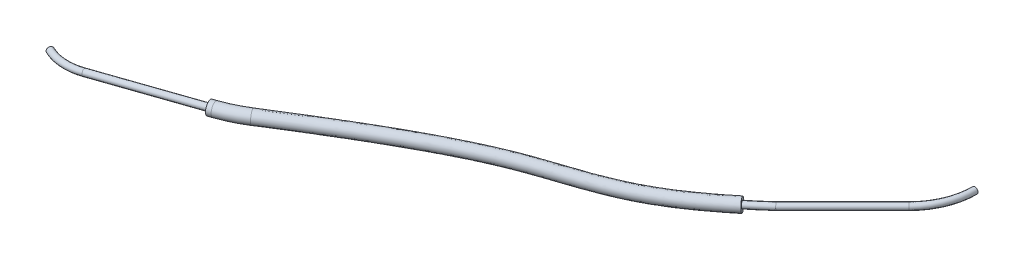
ISO-10303-21;
HEADER;
FILE_DESCRIPTION(('STEP AP214'),'2;1');
FILE_NAME('part.step','',(''),(''),'','','');
FILE_SCHEMA(('AUTOMOTIVE_DESIGN { 1 0 10303 214 1 1 1 1 }'));
ENDSEC;
DATA;
#1=APPLICATION_CONTEXT('core data for automotive mechanical design processes');
#2=APPLICATION_PROTOCOL_DEFINITION('international standard','automotive_design',2000,#1);
#3=PRODUCT_CONTEXT('',#1,'mechanical');
#4=PRODUCT('Part','Part','',(#3));
#5=PRODUCT_RELATED_PRODUCT_CATEGORY('part','',(#4));
#6=PRODUCT_DEFINITION_FORMATION('','',#4);
#7=PRODUCT_DEFINITION_CONTEXT('part definition',#1,'design');
#8=PRODUCT_DEFINITION('design','',#6,#7);
#9=PRODUCT_DEFINITION_SHAPE('','',#8);
#10=(LENGTH_UNIT() NAMED_UNIT(*) SI_UNIT(.MILLI.,.METRE.));
#11=(NAMED_UNIT(*) PLANE_ANGLE_UNIT() SI_UNIT($,.RADIAN.));
#12=(NAMED_UNIT(*) SI_UNIT($,.STERADIAN.) SOLID_ANGLE_UNIT());
#13=UNCERTAINTY_MEASURE_WITH_UNIT(LENGTH_MEASURE(1.E-05),#10,'distance_accuracy_value','');
#14=(GEOMETRIC_REPRESENTATION_CONTEXT(3) GLOBAL_UNCERTAINTY_ASSIGNED_CONTEXT((#13)) GLOBAL_UNIT_ASSIGNED_CONTEXT((#10,
#11,#12)) REPRESENTATION_CONTEXT('',''));
#15=CARTESIAN_POINT('',(0.,0.,0.));
#16=DIRECTION('',(0.,0.,1.));
#17=DIRECTION('',(1.,0.,0.));
#18=AXIS2_PLACEMENT_3D('',#15,#16,#17);
#19=CARTESIAN_POINT('',(-65.4426826596418,2.06849233706446,49.9182708471425));
#20=CARTESIAN_POINT('',(-64.6102753777619,2.06849233706446,49.391673894219));
#21=CARTESIAN_POINT('',(-63.7929251499852,2.06700167169548,48.8755477676007));
#22=CARTESIAN_POINT('',(-62.1339599421459,2.06054145969654,47.8301746670578));
#23=CARTESIAN_POINT('',(-61.3030964183681,2.05557102387871,47.3077297979915));
#24=CARTESIAN_POINT('',(-58.8215813451933,2.0347770937374,45.7512162617422));
#25=CARTESIAN_POINT('',(-57.1819886843264,2.01300027820405,44.7279976841103));
#26=CARTESIAN_POINT('',(-52.4296548507018,1.92047417208794,41.7817859247177));
#27=CARTESIAN_POINT('',(-49.5025366881248,1.82191582611916,39.9946527482901));
#28=CARTESIAN_POINT('',(-44.4018571153965,1.55219085838636,36.9506652043236));
#29=CARTESIAN_POINT('',(-42.2558866226073,1.38262635289105,35.71018113905));
#30=CARTESIAN_POINT('',(-38.6042879357305,1.00423719023995,33.6747761150723));
#31=CARTESIAN_POINT('',(-37.1058669510985,0.796083958782148,32.8841045188624));
#32=CARTESIAN_POINT('',(-32.3335035915576,0.137244470140917,30.4101112448493));
#33=CARTESIAN_POINT('',(-29.3738064994366,-0.250248504691796,28.9507030985919));
#34=CARTESIAN_POINT('',(-22.4585702623827,-0.520796958339956,24.8597915613958));
#35=CARTESIAN_POINT('',(-18.423417511007,-0.394775833983985,22.1557666566223));
#36=CARTESIAN_POINT('',(-13.3244043673123,0.00183984264517314,18.3869241579518));
#37=CARTESIAN_POINT('',(-13.270944706091,0.00599818721492958,18.3474102776392));
#38=CARTESIAN_POINT('',(-13.2174376093601,0.0101601710598621,18.3078614099652));
#39=CARTESIAN_POINT('',(-65.4381107979406,3.06845577156662,49.9254977233154));
#40=CARTESIAN_POINT('',(-64.6050922343713,3.06845577156662,49.3985140617673));
#41=CARTESIAN_POINT('',(-63.7865733867491,3.06696357092638,48.8816496181198));
#42=CARTESIAN_POINT('',(-62.1256223264723,3.06049562576873,47.835025162853));
#43=CARTESIAN_POINT('',(-61.2936940508778,3.05551899800707,47.3119106662541));
#44=CARTESIAN_POINT('',(-58.8087362582996,3.03469621948344,45.7532377116805));
#45=CARTESIAN_POINT('',(-57.1665174055428,3.01288698679012,44.7283785866687));
#46=CARTESIAN_POINT('',(-52.4050143259691,2.92018235903236,41.7764823657161));
#47=CARTESIAN_POINT('',(-49.47006761625,2.8214130863456,39.9845327487139));
#48=CARTESIAN_POINT('',(-44.3482758505009,2.55057170291108,36.9279459271482));
#49=CARTESIAN_POINT('',(-42.1885467724541,2.38001772986634,35.67943423222));
#50=CARTESIAN_POINT('',(-38.5083815746263,1.99866842814678,33.6281063224491));
#51=CARTESIAN_POINT('',(-36.9954275717413,1.78848513561747,32.8298370713756));
#52=CARTESIAN_POINT('',(-32.2271851522407,1.1302145560084,30.3579801029781));
#53=CARTESIAN_POINT('',(-29.3035152692518,0.747674788959855,28.9165195231707));
#54=CARTESIAN_POINT('',(-22.4644474862148,0.480106329948712,24.8706699632628));
#55=CARTESIAN_POINT('',(-18.4637070528184,0.603818369143604,22.1913415799205));
#56=CARTESIAN_POINT('',(-13.3719138530857,0.999872464873213,18.4278355613067));
#57=CARTESIAN_POINT('',(-13.3183783613633,1.00403670768279,18.3882656323656));
#58=CARTESIAN_POINT('',(-13.2648712646325,1.00819869152773,18.3487167646916));
#59=CARTESIAN_POINT('',(-65.9727126154962,3.07700735964332,49.080436916623));
#60=CARTESIAN_POINT('',(-65.1607274190772,3.07700735964333,48.5667593701128));
#61=CARTESIAN_POINT('',(-64.3201988744975,3.07551432129176,48.0359716980104));
#62=CARTESIAN_POINT('',(-62.6581498300179,3.06904210186145,46.9886553637765));
#63=CARTESIAN_POINT('',(-61.8256299161155,3.06406204155318,46.4651687778065));
#64=CARTESIAN_POINT('',(-59.3387467631631,3.04322313290593,44.9052881540032));
#65=CARTESIAN_POINT('',(-57.6950445453075,3.02139571237269,43.8795023095906));
#66=CARTESIAN_POINT('',(-52.9282735509548,2.92858853487628,40.9243402423145));
#67=CARTESIAN_POINT('',(-49.9887559087386,2.82970040734503,39.1295753690479));
#68=CARTESIAN_POINT('',(-44.8538592637965,2.5581660984793,36.0651678080226));
#69=CARTESIAN_POINT('',(-42.6853370021809,2.38699985190207,34.8115094615921));
#70=CARTESIAN_POINT('',(-38.9843890052978,2.00349708059357,32.7485971980384));
#71=CARTESIAN_POINT('',(-37.4592056149536,1.79164389560076,31.9438806081163));
#72=CARTESIAN_POINT('',(-32.6779917115173,1.13158257175767,29.4652992221522));
#73=CARTESIAN_POINT('',(-29.7769317773052,0.752648875727635,28.0347260838656));
#74=CARTESIAN_POINT('',(-23.0089551075967,0.487863711207262,24.0309325790171));
#75=CARTESIAN_POINT('',(-19.0493347837529,0.609169364875249,21.3807017012264));
#76=CARTESIAN_POINT('',(-13.9666292911484,1.004516601715,17.6239126829848));
#77=CARTESIAN_POINT('',(-13.912998351956,1.00868826860766,17.5842722059195));
#78=CARTESIAN_POINT('',(-13.8594912552251,1.01285025245259,17.5447233382454));
#79=CARTESIAN_POINT('',(-65.9772844771974,2.07704392514116,49.07321004045));
#80=CARTESIAN_POINT('',(-65.1659105624679,2.07704392514116,48.5599192025645));
#81=CARTESIAN_POINT('',(-64.3265506377336,2.07555242206096,48.0298698474913));
#82=CARTESIAN_POINT('',(-62.6664874456915,2.06908793578915,46.9838048679813));
#83=CARTESIAN_POINT('',(-61.8350322836058,2.06411406742471,46.4609879095439));
#84=CARTESIAN_POINT('',(-59.3515918500569,2.0433040071601,44.9032667040649));
#85=CARTESIAN_POINT('',(-57.7105158240911,2.02150900378682,43.879121407029));
#86=CARTESIAN_POINT('',(-52.9529140756875,1.92888034793146,40.9296438013226));
#87=CARTESIAN_POINT('',(-50.0212249806134,1.83020314711826,39.1396953686241));
#88=CARTESIAN_POINT('',(-44.9074405286921,1.5597852539549,36.087887085198));
#89=CARTESIAN_POINT('',(-42.7526768523342,1.38960847492678,34.842256368422));
#90=CARTESIAN_POINT('',(-39.080295366402,1.00906584268674,32.7952669906617));
#91=CARTESIAN_POINT('',(-37.5696449943108,0.799242718765438,31.9981480556017));
#92=CARTESIAN_POINT('',(-32.7843101508342,0.138612485890187,29.5174303640267));
#93=CARTESIAN_POINT('',(-29.8472230074899,-0.245274417924015,28.0689096592868));
#94=CARTESIAN_POINT('',(-23.0030778837645,-0.513039577081406,24.0200541771501));
#95=CARTESIAN_POINT('',(-19.0090452419415,-0.389424838252339,21.3451267779283));
#96=CARTESIAN_POINT('',(-13.919119805375,0.00648397948695943,17.58300127963));
#97=CARTESIAN_POINT('',(-13.8655646966836,0.0106497481397963,17.5434168511931));
#98=CARTESIAN_POINT('',(-13.8120575999528,0.0148117319847287,17.5038679835191));
#99=CARTESIAN_POINT('',(-65.9818563388986,1.07708049063899,49.0659831642771));
#100=CARTESIAN_POINT('',(-65.1710937058585,1.077080490639,48.5530790350161));
#101=CARTESIAN_POINT('',(-64.3329024009697,1.07559052283016,48.0237679969721));
#102=CARTESIAN_POINT('',(-62.6748250613651,1.06913376971684,46.9789543721861));
#103=CARTESIAN_POINT('',(-61.844434651096,1.06416609329625,46.4568070412814));
#104=CARTESIAN_POINT('',(-59.3644369369507,1.04338488141427,44.9012452541266));
#105=CARTESIAN_POINT('',(-57.7259871028747,1.02162229520095,43.8787405044673));
#106=CARTESIAN_POINT('',(-52.9775546004201,0.929172160986636,40.9349473603306));
#107=CARTESIAN_POINT('',(-50.0536940524883,0.830705886891494,39.1498153682004));
#108=CARTESIAN_POINT('',(-44.9610217935878,0.561404409430505,36.1106063623733));
#109=CARTESIAN_POINT('',(-42.8200167024874,0.392217097951485,34.8730032752519));
#110=CARTESIAN_POINT('',(-39.1762017275061,0.0146346047799046,32.8419367832849));
#111=CARTESIAN_POINT('',(-37.6800843736681,-0.193158458069882,32.0524155030871));
#112=CARTESIAN_POINT('',(-32.8906285901511,-0.854357599977295,29.5695615059013));
#113=CARTESIAN_POINT('',(-29.9175142376746,-1.24319771157567,28.103093234708));
#114=CARTESIAN_POINT('',(-22.9972006599323,-1.51394286537007,24.0091757752831));
#115=CARTESIAN_POINT('',(-18.9687557001301,-1.38801904137993,21.3095518546301));
#116=CARTESIAN_POINT('',(-13.8716103196015,-0.99154864274108,17.5420898762751));
#117=CARTESIAN_POINT('',(-13.8181310414113,-0.987388772328068,17.5025614964667));
#118=CARTESIAN_POINT('',(-13.7646239446804,-0.983226788483136,17.4630126287927));
#119=CARTESIAN_POINT('',(-65.447254521343,1.06852890256229,49.9110439709695));
#120=CARTESIAN_POINT('',(-64.6154585211526,1.06852890256229,49.3848337266706));
#121=CARTESIAN_POINT('',(-63.7992769132212,1.06703977246457,48.8694459170815));
#122=CARTESIAN_POINT('',(-62.1422975578195,1.06058729362434,47.8253241712626));
#123=CARTESIAN_POINT('',(-61.3124987858583,1.05562304975035,47.3035489297289));
#124=CARTESIAN_POINT('',(-58.8344264320871,1.03485796799136,45.7491948118039));
#125=CARTESIAN_POINT('',(-57.19745996311,1.01311356961798,44.7276167815518));
#126=CARTESIAN_POINT('',(-52.4542953754344,0.920765985143523,41.7870894837192));
#127=CARTESIAN_POINT('',(-49.5350057599997,0.822418565892712,40.0047727478663));
#128=CARTESIAN_POINT('',(-44.4554383802922,0.553810013861637,36.9733844814989));
#129=CARTESIAN_POINT('',(-42.3232264727606,0.385234975915752,35.7409280458799));
#130=CARTESIAN_POINT('',(-38.7001942968346,0.00980595233311817,33.7214459076956));
#131=CARTESIAN_POINT('',(-37.2163063304558,-0.196317218053172,32.9383719663492));
#132=CARTESIAN_POINT('',(-32.4398220308745,-0.855725615726565,30.4622423867205));
#133=CARTESIAN_POINT('',(-29.4440977296213,-1.24817179834345,28.9848866740131));
#134=CARTESIAN_POINT('',(-22.4526930385505,-1.52170024662862,24.8489131595288));
#135=CARTESIAN_POINT('',(-18.3831279691956,-1.39337003711157,22.1201917333241));
#136=CARTESIAN_POINT('',(-13.2768948815388,-0.996192779582866,18.3460127545969));
#137=CARTESIAN_POINT('',(-13.2235110508186,-0.992040333252935,18.3065549229128));
#138=CARTESIAN_POINT('',(-13.1700039540878,-0.987878349408002,18.2670060552388));
#139=CARTESIAN_POINT('',(-65.4426826596418,2.06849233706446,49.9182708471425));
#140=CARTESIAN_POINT('',(-64.6102753777619,2.06849233706446,49.391673894219));
#141=CARTESIAN_POINT('',(-63.7929251499852,2.06700167169548,48.8755477676007));
#142=CARTESIAN_POINT('',(-62.1339599421459,2.06054145969654,47.8301746670578));
#143=CARTESIAN_POINT('',(-61.3030964183681,2.05557102387871,47.3077297979915));
#144=CARTESIAN_POINT('',(-58.8215813451933,2.0347770937374,45.7512162617422));
#145=CARTESIAN_POINT('',(-57.1819886843264,2.01300027820405,44.7279976841103));
#146=CARTESIAN_POINT('',(-52.4296548507018,1.92047417208794,41.7817859247177));
#147=CARTESIAN_POINT('',(-49.5025366881248,1.82191582611916,39.9946527482901));
#148=CARTESIAN_POINT('',(-44.4018571153965,1.55219085838636,36.9506652043236));
#149=CARTESIAN_POINT('',(-42.2558866226073,1.38262635289105,35.71018113905));
#150=CARTESIAN_POINT('',(-38.6042879357305,1.00423719023995,33.6747761150723));
#151=CARTESIAN_POINT('',(-37.1058669510985,0.796083958782148,32.8841045188624));
#152=CARTESIAN_POINT('',(-32.3335035915576,0.137244470140917,30.4101112448493));
#153=CARTESIAN_POINT('',(-29.3738064994366,-0.250248504691796,28.9507030985919));
#154=CARTESIAN_POINT('',(-22.4585702623827,-0.520796958339956,24.8597915613958));
#155=CARTESIAN_POINT('',(-18.423417511007,-0.394775833983985,22.1557666566223));
#156=CARTESIAN_POINT('',(-13.3244043673123,0.00183984264517314,18.3869241579518));
#157=CARTESIAN_POINT('',(-13.270944706091,0.00599818721492958,18.3474102776392));
#158=CARTESIAN_POINT('',(-13.2174376093601,0.0101601710598621,18.3078614099652));
#159=(BOUNDED_SURFACE() B_SPLINE_SURFACE(3,3,((#19,#20,#21,#22,#23,#24,#25,#26,#27,#28,#29,#30,
#31,#32,#33,#34,#35,#36,#37,#38),(#39,#40,#41,#42,#43,#44,#45,#46,#47,#48,#49,#50,#51,#52,#53,
#54,#55,#56,#57,#58),(#59,#60,#61,#62,#63,#64,#65,#66,#67,#68,#69,#70,#71,#72,#73,#74,#75,#76,
#77,#78),(#79,#80,#81,#82,#83,#84,#85,#86,#87,#88,#89,#90,#91,#92,#93,#94,#95,#96,#97,#98),(#99,
#100,#101,#102,#103,#104,#105,#106,#107,#108,#109,#110,#111,#112,#113,#114,#115,#116,#117,#118),
(#119,#120,#121,#122,#123,#124,#125,#126,#127,#128,#129,#130,#131,#132,#133,#134,#135,#136,#137,
#138),(#139,#140,#141,#142,#143,#144,#145,#146,#147,#148,#149,#150,#151,#152,#153,#154,#155,
#156,#157,#158)),.UNSPECIFIED.,.T.,.F.,.F.) B_SPLINE_SURFACE_WITH_KNOTS((4,3,4),(4,2,2,2,2,2,2,
2,2,4),(0.,0.5,1.),(0.305472754896942,0.325269174044409,0.345065593191876,0.38465843148681,
0.463844108076677,0.543029784666545,0.622215461256412,0.811107730628206,1.,1.00200497871636),
.UNSPECIFIED.) GEOMETRIC_REPRESENTATION_ITEM() RATIONAL_B_SPLINE_SURFACE(((1.,1.,1.,1.,1.,1.,1.,
1.,1.,1.,1.,1.,1.,1.,1.,1.,1.,1.,1.,1.),(0.333333333333333,0.333333333333333,0.333333333333333,
0.333333333333333,0.333333333333333,0.333333333333333,0.333333333333333,0.333333333333333,
0.333333333333333,0.333333333333333,0.333333333333333,0.333333333333333,0.333333333333333,
0.333333333333333,0.333333333333333,0.333333333333333,0.333333333333333,0.333333333333333,
0.333333333333333,0.333333333333333),(0.333333333333333,0.333333333333333,0.333333333333333,
0.333333333333333,0.333333333333333,0.333333333333333,0.333333333333333,0.333333333333333,
0.333333333333333,0.333333333333333,0.333333333333333,0.333333333333333,0.333333333333333,
0.333333333333333,0.333333333333333,0.333333333333333,0.333333333333333,0.333333333333333,
0.333333333333333,0.333333333333333),(1.,1.,1.,1.,1.,1.,1.,1.,1.,1.,1.,1.,1.,1.,1.,1.,1.,1.,1.,
1.),(0.333333333333333,0.333333333333333,0.333333333333333,0.333333333333333,0.333333333333333,
0.333333333333333,0.333333333333333,0.333333333333333,0.333333333333333,0.333333333333333,
0.333333333333333,0.333333333333333,0.333333333333333,0.333333333333333,0.333333333333333,
0.333333333333333,0.333333333333333,0.333333333333333,0.333333333333333,0.333333333333333),
(0.333333333333333,0.333333333333333,0.333333333333333,0.333333333333333,0.333333333333333,
0.333333333333333,0.333333333333333,0.333333333333333,0.333333333333333,0.333333333333333,
0.333333333333333,0.333333333333333,0.333333333333333,0.333333333333333,0.333333333333333,
0.333333333333333,0.333333333333333,0.333333333333333,0.333333333333333,0.333333333333333),(1.,
1.,1.,1.,1.,1.,1.,1.,1.,1.,1.,1.,1.,1.,1.,1.,1.,1.,1.,1.))) REPRESENTATION_ITEM('') SURFACE());
#160=CARTESIAN_POINT('',(-13.5378979215375,-0.460715130419295,18.161882273065));
#161=CARTESIAN_POINT('',(-13.5356865562389,-0.459269794244226,18.1645190911536));
#162=CARTESIAN_POINT('',(-13.5334861260916,-0.457785587784182,18.167145079573));
#163=CARTESIAN_POINT('',(-13.5147623508182,-0.444761439303766,18.1895089468534));
#164=CARTESIAN_POINT('',(-13.4988857468484,-0.431070062646096,18.2085992418412));
#165=CARTESIAN_POINT('',(-13.4689286861008,-0.399694021228154,18.2448861923355));
#166=CARTESIAN_POINT('',(-13.4548529472416,-0.381999190505139,18.2620778583269));
#167=CARTESIAN_POINT('',(-13.4289455499903,-0.343149602673817,18.2940218901515));
#168=CARTESIAN_POINT('',(-13.4171111157445,-0.321999186615379,18.3087772703792));
#169=CARTESIAN_POINT('',(-13.3960082903749,-0.276821295379049,18.3354469439945));
#170=CARTESIAN_POINT('',(-13.3867400843688,-0.252793612825486,18.3473610324139));
#171=CARTESIAN_POINT('',(-13.3710511189185,-0.202584500542406,18.3679866834344));
#172=CARTESIAN_POINT('',(-13.3646257108553,-0.176406670542718,18.3767034703273));
#173=CARTESIAN_POINT('',(-13.354788090261,-0.122603880122333,18.3907081569449));
#174=CARTESIAN_POINT('',(-13.3513761893007,-0.0949787703780195,18.3959957021004));
#175=CARTESIAN_POINT('',(-13.3476762103342,-0.03918035333438,18.402970307561));
#176=CARTESIAN_POINT('',(-13.3473762536086,-0.011009542164359,18.4046710393928));
#177=CARTESIAN_POINT('',(-13.3498835127891,0.0452162878670125,18.4044594711936));
#178=CARTESIAN_POINT('',(-13.3526946684538,0.0732711146472754,18.4025425878237));
#179=CARTESIAN_POINT('',(-13.3613376194082,0.128329015074114,18.3951513195469));
#180=CARTESIAN_POINT('',(-13.3671589082242,0.155335397962775,18.3896892916867));
#181=CARTESIAN_POINT('',(-13.3816514764019,0.207629895870593,18.3753738606882));
#182=CARTESIAN_POINT('',(-13.3903227344975,0.232918023709458,18.3665204828555));
#183=CARTESIAN_POINT('',(-13.4102613421827,0.281040770027418,18.3456818329595));
#184=CARTESIAN_POINT('',(-13.4215269851704,0.303876986972607,18.3336986190292));
#185=CARTESIAN_POINT('',(-13.4463198669805,0.346441229793133,18.3069572194803));
#186=CARTESIAN_POINT('',(-13.4598442162993,0.366173165048698,18.2922025763092));
#187=CARTESIAN_POINT('',(-13.4888013861653,0.4020366978953,18.2603046726395));
#188=CARTESIAN_POINT('',(-13.5042370237043,0.41816288052627,18.2431578815968));
#189=CARTESIAN_POINT('',(-13.5365601644972,0.44632558706743,18.2069823151779));
#190=CARTESIAN_POINT('',(-13.5534475464364,0.458362452285035,18.187953697036));
#191=CARTESIAN_POINT('',(-13.5883004702156,0.478074706897065,18.1484353041196));
#192=CARTESIAN_POINT('',(-13.6062718057364,0.485723840060997,18.127937542219));
#193=CARTESIAN_POINT('',(-13.6426886739558,0.496338543886833,18.0861666080557));
#194=CARTESIAN_POINT('',(-13.661134180966,0.499304367725437,18.0648934777725));
#195=CARTESIAN_POINT('',(-13.6979940146055,0.500478997663377,18.0221550312929));
#196=CARTESIAN_POINT('',(-13.7164082846383,0.498682568844151,18.000689529475));
#197=CARTESIAN_POINT('',(-13.7526357057766,0.490378169591167,17.9582302310792));
#198=CARTESIAN_POINT('',(-13.7704501543346,0.48388115763061,17.9372354542602));
#199=CARTESIAN_POINT('',(-13.7938785162996,0.472020812360587,17.9094653404048));
#200=CARTESIAN_POINT('',(-13.799976713768,0.468611532299088,17.9022215570365));
#201=CARTESIAN_POINT('',(-13.8082215848415,0.463557936257391,17.8924065080213));
#202=CARTESIAN_POINT('',(-13.8104363186998,0.462155531277695,17.889767837481));
#203=CARTESIAN_POINT('',(-13.8126398764997,0.460715125416697,17.8871403181087));
#204=B_SPLINE_CURVE_WITH_KNOTS('',3,(#160,#161,#162,#163,#164,#165,#166,#167,#168,#169,#170,
#171,#172,#173,#174,#175,#176,#177,#178,#179,#180,#181,#182,#183,#184,#185,#186,#187,#188,#189,
#190,#191,#192,#193,#194,#195,#196,#197,#198,#199,#200,#201,#202,#203),.UNSPECIFIED.,.F.,.F.,(4,
2,2,2,2,2,2,2,2,2,2,2,2,2,2,2,2,2,2,2,2,4),(0.,0.0112000663848856,0.0958052396493848,
0.180627711098075,0.265344432985468,0.350067264412228,0.434651038083643,0.519243555969623,
0.603513053224276,0.687889387428363,0.771973185388852,0.856056355940638,0.940084373270497,
1.0240057077981,1.10805223763035,1.19209175094806,1.27662904770678,1.36116177427694,
1.44578746218685,1.53021649527374,1.56039478878953,1.57155247138295),.UNSPECIFIED.);
#205=CARTESIAN_POINT('',(-13.5378979215375,-0.460715130419295,18.161882273065));
#206=VERTEX_POINT('',#205);
#207=CARTESIAN_POINT('',(-13.8126398764997,0.460715125416697,17.8871403181087));
#208=VERTEX_POINT('',#207);
#209=EDGE_CURVE('E45',#206,#208,#204,.T.);
#210=CARTESIAN_POINT('',(-13.5378979215375,-0.460715130419295,18.161882273065));
#211=CARTESIAN_POINT('',(-13.5401092840379,-0.462160882237253,18.1592456805021));
#212=CARTESIAN_POINT('',(-13.5423326762077,-0.463568479870211,18.1565969500472));
#213=CARTESIAN_POINT('',(-13.561448846803,-0.475279895617532,18.133842548911));
#214=CARTESIAN_POINT('',(-13.5789794919363,-0.483426524539769,18.1130996889565));
#215=CARTESIAN_POINT('',(-13.614823236526,-0.49506400228763,18.0709284942048));
#216=CARTESIAN_POINT('',(-13.6331382299992,-0.498542839431998,18.0494985356638));
#217=CARTESIAN_POINT('',(-13.6699826224744,-0.50071400508809,18.006618808449));
#218=CARTESIAN_POINT('',(-13.6885117256247,-0.499412297110749,17.9851690978045));
#219=CARTESIAN_POINT('',(-13.7252765162659,-0.492062832103886,17.9428374716927));
#220=CARTESIAN_POINT('',(-13.7435121824848,-0.486014732566532,17.9219555973139));
#221=CARTESIAN_POINT('',(-13.7791396483347,-0.469351892507442,17.881390152715));
#222=CARTESIAN_POINT('',(-13.7965327796937,-0.458744639022881,17.8617046780027));
#223=CARTESIAN_POINT('',(-13.8300108112177,-0.433258227775062,17.8240571341033));
#224=CARTESIAN_POINT('',(-13.846095575916,-0.418378628378532,17.8060952433397));
#225=CARTESIAN_POINT('',(-13.8764338665733,-0.384832076795157,17.7724790116121));
#226=CARTESIAN_POINT('',(-13.890694143873,-0.36617978824448,17.7568161296995));
#227=CARTESIAN_POINT('',(-13.9170633264874,-0.325553481101683,17.7281474566164));
#228=CARTESIAN_POINT('',(-13.9291694813903,-0.30357528122789,17.7151450592582));
#229=CARTESIAN_POINT('',(-13.9508216913128,-0.257022521653243,17.6922373208746));
#230=CARTESIAN_POINT('',(-13.9603764845967,-0.232457236498461,17.6823213890335));
#231=CARTESIAN_POINT('',(-13.9767084592294,-0.181366041911645,17.6658088170999));
#232=CARTESIAN_POINT('',(-13.9834856614682,-0.154840147226906,17.6592121520435));
#233=CARTESIAN_POINT('',(-13.9940666339223,-0.100601126885592,17.6495285289695));
#234=CARTESIAN_POINT('',(-13.9978723732716,-0.0728888003231526,17.6464392460566));
#235=CARTESIAN_POINT('',(-14.0024092071459,-0.0170838262586906,17.6438492936803));
#236=CARTESIAN_POINT('',(-14.0031441992031,0.0110082937044616,17.6443440729789));
#237=CARTESIAN_POINT('',(-14.0015318835133,0.0668547611503039,17.6488967179982));
#238=CARTESIAN_POINT('',(-13.9991799900579,0.0946085441528046,17.6529598817467));
#239=CARTESIAN_POINT('',(-13.9914573697355,0.148949203133318,17.6645357908128));
#240=CARTESIAN_POINT('',(-13.986086894811,0.175536176298153,17.6720482482295));
#241=CARTESIAN_POINT('',(-13.9724431448333,0.226951458678321,17.6903595321044));
#242=CARTESIAN_POINT('',(-13.9641528363509,0.251768397749509,17.7011775923276));
#243=CARTESIAN_POINT('',(-13.9449155472735,0.298765500325206,17.7257720037564));
#244=CARTESIAN_POINT('',(-13.9339687101659,0.3209458061461,17.7395481951796));
#245=CARTESIAN_POINT('',(-13.909722116234,0.362067204812042,17.7696770753309));
#246=CARTESIAN_POINT('',(-13.8964197856481,0.38100470938512,17.7860325802199));
#247=CARTESIAN_POINT('',(-13.8678687816414,0.415047572403232,17.8208193347297));
#248=CARTESIAN_POINT('',(-13.8526247029845,0.430161733761824,17.8392456723938));
#249=CARTESIAN_POINT('',(-13.8309218109392,0.447804762251086,17.8652927886424));
#250=CARTESIAN_POINT('',(-13.8251119521665,0.452180057786229,17.872248873063));
#251=CARTESIAN_POINT('',(-13.8170352451886,0.457796248562836,17.881896605423));
#252=CARTESIAN_POINT('',(-13.8148432790117,0.459274602680102,17.8845127325923));
#253=CARTESIAN_POINT('',(-13.8126398764997,0.460715125416697,17.8871403181087));
#254=B_SPLINE_CURVE_WITH_KNOTS('',3,(#210,#211,#212,#213,#214,#215,#216,#217,#218,#219,#220,
#221,#222,#223,#224,#225,#226,#227,#228,#229,#230,#231,#232,#233,#234,#235,#236,#237,#238,#239,
#240,#241,#242,#243,#244,#245,#246,#247,#248,#249,#250,#251,#252,#253),.UNSPECIFIED.,.F.,.F.,(4,
2,2,2,2,2,2,2,2,2,2,2,2,2,2,2,2,2,2,2,2,4),(0.,0.0112000663874568,0.0958051101549704,
0.180627454146606,0.26534402211359,0.350066703936942,0.434650782689015,0.519243608064364,
0.603513748150849,0.687890725212272,0.771974897582945,0.856058437554404,0.940086209500611,
1.024007297113,1.10805319452147,1.19209207817645,1.27662956924746,1.3611624952018,
1.44578836365626,1.53021757770864,1.56039604702367,1.57155372961462),.UNSPECIFIED.);
#255=EDGE_CURVE('E88',#206,#208,#254,.T.);
#256=CARTESIAN_POINT('',(-16.5050018744213,-0.219071813146706,20.6994341208813));
#257=CARTESIAN_POINT('',(-16.5060329780596,-0.191001092454372,20.70036871886));
#258=CARTESIAN_POINT('',(-16.508446831216,-0.162935365825468,20.6993677582702));
#259=CARTESIAN_POINT('',(-16.5159704711166,-0.107529866635176,20.6935314456114));
#260=CARTESIAN_POINT('',(-16.5210834966095,-0.0801910077285436,20.6886914835944));
#261=CARTESIAN_POINT('',(-16.5338599799979,-0.0270803038708845,20.6753095490744));
#262=CARTESIAN_POINT('',(-16.5415218819515,-0.00130751424848186,20.6667698340981));
#263=CARTESIAN_POINT('',(-16.5591793921245,0.0479614462917393,20.6462315956375));
#264=CARTESIAN_POINT('',(-16.5691750665521,0.0714575525942129,20.6342329740232));
#265=CARTESIAN_POINT('',(-16.5912148648392,0.115500987542944,20.6071192010348));
#266=CARTESIAN_POINT('',(-16.6032587059818,0.13604872244443,20.5920044797279));
#267=CARTESIAN_POINT('',(-16.6290544311729,0.173616786661499,20.5590858898165));
#268=CARTESIAN_POINT('',(-16.6428063811589,0.190636979737117,20.541281917394));
#269=CARTESIAN_POINT('',(-16.6716161646539,0.220653799228828,20.5035056144992));
#270=CARTESIAN_POINT('',(-16.6866729714193,0.233653553032602,20.4835349858268));
#271=CARTESIAN_POINT('',(-16.7176956324772,0.255293531900468,20.4419522787048));
#272=CARTESIAN_POINT('',(-16.7336626725632,0.263927918631737,20.4203380462491));
#273=CARTESIAN_POINT('',(-16.7660222519681,0.276561300214824,20.3761214824634));
#274=CARTESIAN_POINT('',(-16.78241448946,0.280563495891872,20.3535198446467));
#275=CARTESIAN_POINT('',(-16.8151706317794,0.283830097179454,20.307954926105));
#276=CARTESIAN_POINT('',(-16.8315345352716,0.283094285269657,20.2849916288246));
#277=CARTESIAN_POINT('',(-16.8637694574889,0.276905444847073,20.2393552658252));
#278=CARTESIAN_POINT('',(-16.8796404566055,0.271452228915915,20.2166822116736));
#279=CARTESIAN_POINT('',(-16.9104394117842,0.255982993357433,20.1722694018181));
#280=CARTESIAN_POINT('',(-16.9253673158602,0.245966722450973,20.1505296975843));
#281=CARTESIAN_POINT('',(-16.9538476772118,0.221662667854667,20.1086134009631));
#282=CARTESIAN_POINT('',(-16.9674008876919,0.207377240385531,20.0884359540537));
#283=CARTESIAN_POINT('',(-16.9927742258486,0.174916174380563,20.0501769734118));
#284=CARTESIAN_POINT('',(-17.0045920175055,0.156735371793506,20.032098271496));
#285=CARTESIAN_POINT('',(-17.0261237431368,0.117036444588926,19.9986025033391));
#286=CARTESIAN_POINT('',(-17.0358402540256,0.0955224638734395,19.9831821817461));
#287=CARTESIAN_POINT('',(-17.0529246452715,0.0497183153436173,19.9553932577071));
#288=CARTESIAN_POINT('',(-17.0602892106619,0.0254242940731986,19.9430289681039));
#289=CARTESIAN_POINT('',(-17.072432707388,-0.0251874025787329,19.9217475300328));
#290=CARTESIAN_POINT('',(-17.0772154196756,-0.051502053973211,19.9128253463278));
#291=CARTESIAN_POINT('',(-17.0840819008263,-0.105485886495867,19.8986433696488));
#292=CARTESIAN_POINT('',(-17.0861611523134,-0.133157254807714,19.8933897134013));
#293=CARTESIAN_POINT('',(-17.0875465578198,-0.189025974438399,19.8867187472714));
#294=CARTESIAN_POINT('',(-17.0868527971177,-0.217223309555627,19.8853013194157));
#295=CARTESIAN_POINT('',(-17.0827154539996,-0.273295885481676,19.8863420687991));
#296=CARTESIAN_POINT('',(-17.0792764577489,-0.301171584888044,19.8887937889428));
#297=CARTESIAN_POINT('',(-17.0697447925277,-0.355897669419543,19.8974978388204));
#298=CARTESIAN_POINT('',(-17.063648355486,-0.38274653955311,19.9037555702192));
#299=CARTESIAN_POINT('',(-17.0489845974851,-0.434576667698295,19.9198871763157));
#300=CARTESIAN_POINT('',(-17.0404207531473,-0.45956049165859,19.9297559682098));
#301=CARTESIAN_POINT('',(-17.0210495755721,-0.507022796744365,19.9528454764798));
#302=CARTESIAN_POINT('',(-17.0102395145579,-0.529498180162792,19.9660702727055));
#303=CARTESIAN_POINT('',(-16.9867053566897,-0.5712411036727,19.9954702285648));
#304=CARTESIAN_POINT('',(-16.9739838292849,-0.590512877989204,20.0116414336613));
#305=CARTESIAN_POINT('',(-16.9469689482095,-0.625348632924656,20.0464976375591));
#306=CARTESIAN_POINT('',(-16.9326746896084,-0.640910462407283,20.0651840849963));
#307=CARTESIAN_POINT('',(-16.9029270466028,-0.667869261515412,20.1045319208864));
#308=CARTESIAN_POINT('',(-16.8874737255861,-0.67926645869977,20.1251932013549));
#309=CARTESIAN_POINT('',(-16.8558456911426,-0.697573930665554,20.16790538261));
#310=CARTESIAN_POINT('',(-16.8396709662551,-0.704484134136494,20.1899563054756));
#311=CARTESIAN_POINT('',(-16.8070602716996,-0.713621186355137,20.2348204415648));
#312=CARTESIAN_POINT('',(-16.7906243136395,-0.715848242616293,20.2576336209667));
#313=CARTESIAN_POINT('',(-16.7579445381768,-0.715556564197994,20.3033930541692));
#314=CARTESIAN_POINT('',(-16.7417008744963,-0.713034260788485,20.3263393951123));
#315=CARTESIAN_POINT('',(-16.709901235173,-0.703315413534404,20.3716655818332));
#316=CARTESIAN_POINT('',(-16.6943443729924,-0.696125095584498,20.3940461409665));
#317=CARTESIAN_POINT('',(-16.6643237158465,-0.677272533591138,20.4376563074178));
#318=CARTESIAN_POINT('',(-16.6498608261243,-0.66560663351333,20.4588849575337));
#319=CARTESIAN_POINT('',(-16.6224532232681,-0.638135330695144,20.4995682169294));
#320=CARTESIAN_POINT('',(-16.6095084518032,-0.622330087076987,20.5190228943644));
#321=CARTESIAN_POINT('',(-16.585501507269,-0.587025172845189,20.5556105087975));
#322=CARTESIAN_POINT('',(-16.5744396689394,-0.567524846635391,20.5727430328634));
#323=CARTESIAN_POINT('',(-16.5545155322819,-0.525386776843487,20.6041956075789));
#324=CARTESIAN_POINT('',(-16.5456531708824,-0.502749123255763,20.6185157388737));
#325=CARTESIAN_POINT('',(-16.5303738890309,-0.454957954174669,20.643946748586));
#326=CARTESIAN_POINT('',(-16.5239587040977,-0.429802669097519,20.655055348063));
#327=CARTESIAN_POINT('',(-16.5137702315977,-0.377748954969026,20.6737229058108));
#328=CARTESIAN_POINT('',(-16.5099937768004,-0.350852658165649,20.6812861159592));
#329=CARTESIAN_POINT('',(-16.5045829867759,-0.289188909774854,20.694081377352));
#330=CARTESIAN_POINT('',(-16.5037142344678,-0.254126467349954,20.6982669969829));
#331=CARTESIAN_POINT('',(-16.5050018744213,-0.219071813146706,20.6994341208813));
#332=B_SPLINE_CURVE_WITH_KNOTS('',3,(#256,#257,#258,#259,#260,#261,#262,#263,#264,#265,#266,
#267,#268,#269,#270,#271,#272,#273,#274,#275,#276,#277,#278,#279,#280,#281,#282,#283,#284,#285,
#286,#287,#288,#289,#290,#291,#292,#293,#294,#295,#296,#297,#298,#299,#300,#301,#302,#303,#304,
#305,#306,#307,#308,#309,#310,#311,#312,#313,#314,#315,#316,#317,#318,#319,#320,#321,#322,#323,
#324,#325,#326,#327,#328,#329,#330,#331),.UNSPECIFIED.,.T.,.F.,(4,2,2,2,2,2,2,2,2,2,2,2,2,2,2,2,
2,2,2,2,2,2,2,2,2,2,2,2,2,2,2,2,2,2,2,2,2,4),(0.,0.0841844499309548,0.168470143521911,
0.252704479683935,0.33694120583028,0.421166313853948,0.505394674195759,0.589557349886835,
0.67383229069036,0.758048963019369,0.84226950173499,0.926493386613283,1.01072191010845,
1.0949040320221,1.1791984513868,1.26338890223815,1.34769749752291,1.43188229122506,
1.5162075743685,1.6005302642751,1.68471237953249,1.76901424959104,1.85319791287198,
1.93748441152816,2.02165860699027,2.1058814910894,2.19009977249408,2.27431939232267,
2.35853528024374,2.44281447432238,2.5269814925735,2.61121741247315,2.69545009470006,
2.77969773583952,2.86394296083147,2.94824782130104,3.0324513172054,3.13758067294818),.UNSPECIFIED.);
#333=CARTESIAN_POINT('',(-16.5050018744213,-0.219071813146706,20.6994341208813));
#334=VERTEX_POINT('',#333);
#335=EDGE_CURVE('E11',#334,#334,#332,.T.);
#336=ORIENTED_EDGE('',*,*,#209,.T.);
#337=ORIENTED_EDGE('',*,*,#255,.F.);
#338=EDGE_LOOP('',(#336,#337));
#339=FACE_BOUND('',#338,.T.);
#340=ORIENTED_EDGE('',*,*,#335,.F.);
#341=EDGE_LOOP('',(#340));
#342=FACE_BOUND('',#341,.T.);
#343=ADVANCED_FACE('F33',(#339,#342),#159,.F.);
#344=CARTESIAN_POINT('',(0.,0.,0.));
#345=DIRECTION('',(0.,0.,1.));
#346=DIRECTION('',(1.,0.,0.));
#347=AXIS2_PLACEMENT_3D('',#344,#345,#346);
#348=PLANE('',#347);
#349=CARTESIAN_POINT('',(0.,0.,0.));
#350=DIRECTION('',(0.,0.,1.));
#351=DIRECTION('',(1.,0.,0.));
#352=AXIS2_PLACEMENT_3D('',#349,#350,#351);
#353=CIRCLE('',#352,0.5);
#354=CARTESIAN_POINT('',(0.5,0.,0.));
#355=VERTEX_POINT('',#354);
#356=EDGE_CURVE('E50',#355,#355,#353,.T.);
#357=ORIENTED_EDGE('',*,*,#356,.F.);
#358=EDGE_LOOP('',(#357));
#359=FACE_BOUND('',#358,.T.);
#360=ADVANCED_FACE('F35',(#359),#348,.F.);
#361=CARTESIAN_POINT('',(-13.8166902510868,-1.2313077903915E-11,18.1659326560032));
#362=DIRECTION('',(0.707106781186412,8.15373390839103E-13,-0.707106781186683));
#363=DIRECTION('',(-0.707106781186683,0.,-0.707106781186412));
#364=AXIS2_PLACEMENT_3D('',#361,#362,#363);
#365=CYLINDRICAL_SURFACE('',#364,0.5);
#366=ORIENTED_EDGE('',*,*,#209,.F.);
#367=ORIENTED_EDGE('',*,*,#255,.T.);
#368=EDGE_LOOP('',(#366,#367));
#369=FACE_BOUND('',#368,.T.);
#370=CARTESIAN_POINT('',(-3.07537879754719,0.,7.42462120245955));
#371=DIRECTION('',(-0.707106781186419,-8.15972321656106E-13,0.707106781186676));
#372=DIRECTION('',(0.707106781186676,0.,0.707106781186419));
#373=AXIS2_PLACEMENT_3D('',#370,#371,#372);
#374=CIRCLE('',#373,0.5);
#375=CARTESIAN_POINT('',(-2.72182540695386,0.,7.77817459305276));
#376=VERTEX_POINT('',#375);
#377=EDGE_CURVE('E77',#376,#376,#374,.T.);
#378=ORIENTED_EDGE('',*,*,#377,.T.);
#379=EDGE_LOOP('',(#378));
#380=FACE_BOUND('',#379,.T.);
#381=ADVANCED_FACE('F104',(#369,#380),#365,.T.);
#382=CARTESIAN_POINT('',(-10.5000000000039,0.,-6.80011602582908E-12));
#383=DIRECTION('',(0.,1.,0.));
#384=DIRECTION('',(0.,0.,1.));
#385=AXIS2_PLACEMENT_3D('',#382,#383,#384);
#386=TOROIDAL_SURFACE('',#385,10.5000000000039,0.5);
#387=ORIENTED_EDGE('',*,*,#356,.T.);
#388=EDGE_LOOP('',(#387));
#389=FACE_BOUND('',#388,.T.);
#390=ORIENTED_EDGE('',*,*,#377,.F.);
#391=EDGE_LOOP('',(#390));
#392=FACE_BOUND('',#391,.T.);
#393=ADVANCED_FACE('F108',(#389,#392),#386,.T.);
#394=CARTESIAN_POINT('',(-16.7949749354246,-0.21719215865211,20.293781506509));
#395=DIRECTION('',(-0.812646838860782,-0.0491837456306535,0.580677254983625));
#396=DIRECTION('',(0.581380872797107,0.,0.813631538686692));
#397=AXIS2_PLACEMENT_3D('',#394,#395,#396);
#398=PLANE('',#397);
#399=CARTESIAN_POINT('',(-16.7949749354246,-0.21719215865211,20.293781506509));
#400=DIRECTION('',(-0.812646838860782,-0.0491837456306535,0.580677254983625));
#401=DIRECTION('',(0.581380872797107,0.,0.813631538686692));
#402=AXIS2_PLACEMENT_3D('',#399,#400,#401);
#403=CIRCLE('',#402,1.00000000000003);
#404=CARTESIAN_POINT('',(-16.2135940626274,-0.21719215865211,21.1074130451957));
#405=VERTEX_POINT('',#404);
#406=EDGE_CURVE('E69',#405,#405,#403,.T.);
#407=ORIENTED_EDGE('',*,*,#406,.F.);
#408=EDGE_LOOP('',(#407));
#409=FACE_BOUND('',#408,.T.);
#410=ORIENTED_EDGE('',*,*,#335,.T.);
#411=EDGE_LOOP('',(#410));
#412=FACE_BOUND('',#411,.T.);
#413=ADVANCED_FACE('F111',(#409,#412),#398,.F.);
#414=CARTESIAN_POINT('',(-70.4124208608417,2.072768131115,51.6644931250351));
#415=DIRECTION('',(-0.945518575599572,6.89052981339699E-13,0.325568154456415));
#416=DIRECTION('',(0.325566696642396,-0.00299257203727187,0.945514341800249));
#417=AXIS2_PLACEMENT_3D('',#414,#415,#416);
#418=PLANE('',#417);
#419=CARTESIAN_POINT('',(-70.4124208608404,2.0727681311028,51.6644931250387));
#420=DIRECTION('',(-0.945518575599572,6.89052981339699E-13,0.325568154456415));
#421=DIRECTION('',(0.325568154456415,0.,0.945518575599572));
#422=AXIS2_PLACEMENT_3D('',#419,#420,#421);
#423=CIRCLE('',#422,0.5);
#424=CARTESIAN_POINT('',(-70.2496367836122,2.0727681311028,52.1372524128385));
#425=VERTEX_POINT('',#424);
#426=EDGE_CURVE('E73',#425,#425,#423,.T.);
#427=ORIENTED_EDGE('',*,*,#426,.F.);
#428=EDGE_LOOP('',(#427));
#429=FACE_BOUND('',#428,.T.);
#430=CARTESIAN_POINT('',(-70.4124208608417,2.072768131115,51.6644931250351));
#431=DIRECTION('',(-0.945518575599572,6.89052981339699E-13,0.325568154456415));
#432=DIRECTION('',(0.325566696642396,-0.00299257203727187,0.945514341800249));
#433=AXIS2_PLACEMENT_3D('',#430,#431,#432);
#434=CIRCLE('',#433,1.00000000000003);
#435=CARTESIAN_POINT('',(-70.0868541641993,2.06977555907772,52.6100074668353));
#436=VERTEX_POINT('',#435);
#437=EDGE_CURVE('E157',#436,#436,#434,.T.);
#438=ORIENTED_EDGE('',*,*,#437,.T.);
#439=EDGE_LOOP('',(#438));
#440=FACE_BOUND('',#439,.T.);
#441=ADVANCED_FACE('F116',(#429,#440),#418,.T.);
#442=CARTESIAN_POINT('',(-70.4124208608417,2.072768131115,51.6644931250351));
#443=DIRECTION('',(0.945518575599308,0.,-0.325568154457184));
#444=DIRECTION('',(-0.325568154457184,0.,-0.945518575599308));
#445=AXIS2_PLACEMENT_3D('',#442,#443,#444);
#446=CYLINDRICAL_SURFACE('',#445,1.00000000000003);
#447=CARTESIAN_POINT('',(-69.7491426641499,2.072768131115,51.4361081266211));
#448=DIRECTION('',(-0.945518575599572,6.89052981339699E-13,0.325568154456415));
#449=DIRECTION('',(0.325566696642396,-0.00299257203727187,0.945514341800249));
#450=AXIS2_PLACEMENT_3D('',#447,#448,#449);
#451=CIRCLE('',#450,1.00000000000003);
#452=CARTESIAN_POINT('',(-69.4235745096918,2.072768131115,52.3816267022201));
#453=VERTEX_POINT('',#452);
#454=EDGE_CURVE('E80',#453,#453,#451,.T.);
#455=ORIENTED_EDGE('',*,*,#454,.T.);
#456=EDGE_LOOP('',(#455));
#457=FACE_BOUND('',#456,.T.);
#458=ORIENTED_EDGE('',*,*,#437,.F.);
#459=EDGE_LOOP('',(#458));
#460=FACE_BOUND('',#459,.T.);
#461=ADVANCED_FACE('F127',(#457,#460),#446,.T.);
#462=CARTESIAN_POINT('',(-76.0395103704203,2.072768131115,33.1675538095464));
#463=DIRECTION('',(0.,1.,0.));
#464=DIRECTION('',(0.,0.,1.));
#465=AXIS2_PLACEMENT_3D('',#462,#463,#464);
#466=TOROIDAL_SURFACE('',#465,19.3212008611266,1.00000000000003);
#467=CARTESIAN_POINT('',(-65.7099835684005,2.072768131115,49.4957404437796));
#468=DIRECTION('',(-0.845091707891869,6.94002147416661E-13,0.534621366251298));
#469=DIRECTION('',(0.534618972348481,-0.00299257203727187,0.845087923779327));
#470=AXIS2_PLACEMENT_3D('',#467,#468,#469);
#471=CIRCLE('',#470,1.00000000000003);
#472=CARTESIAN_POINT('',(-65.1753622021477,2.072768131115,50.3408321516706));
#473=VERTEX_POINT('',#472);
#474=EDGE_CURVE('E74',#473,#473,#471,.T.);
#475=CARTESIAN_POINT('',(-76.0395103704203,2.072768131115,33.1675538095464));
#476=DIRECTION('',(0.,1.,0.));
#477=DIRECTION('',(0.,0.,1.));
#478=AXIS2_PLACEMENT_3D('',#475,#476,#477);
#479=CIRCLE('',#478,20.3212008611266);
#480=EDGE_CURVE('',#453,#473,#479,.T.);
#481=ORIENTED_EDGE('',*,*,#454,.F.);
#482=ORIENTED_EDGE('',*,*,#474,.T.);
#483=ORIENTED_EDGE('',*,*,#480,.T.);
#484=ORIENTED_EDGE('',*,*,#480,.F.);
#485=EDGE_LOOP('',(#481,#483,#482,#484));
#486=FACE_BOUND('',#485,.T.);
#487=ADVANCED_FACE('F124',(#486),#466,.T.);
#488=CARTESIAN_POINT('',(-65.175364596052,2.06977555907773,50.340828367559));
#489=CARTESIAN_POINT('',(-64.7591934445429,2.06977555907772,50.0775504445394));
#490=CARTESIAN_POINT('',(-64.362128901611,2.06941261607884,49.8265899925856));
#491=CARTESIAN_POINT('',(-63.5438812220931,2.06789382170395,49.3099167517868));
#492=CARTESIAN_POINT('',(-63.1333139022269,2.06673794452526,49.0509197486312));
#493=CARTESIAN_POINT('',(-61.8993273913178,2.06198464205711,48.2733075404957));
#494=CARTESIAN_POINT('',(-61.0736230048506,2.05709912004369,47.7540719391571));
#495=CARTESIAN_POINT('',(-58.6037561468937,2.03659458555355,46.2047402904179));
#496=CARTESIAN_POINT('',(-56.9668219728926,2.01505186764251,45.1830506843689));
#497=CARTESIAN_POINT('',(-52.2165324705832,1.9231860977645,42.2376927648927));
#498=CARTESIAN_POINT('',(-49.2755280273011,1.82470707352254,40.4417076862574));
#499=CARTESIAN_POINT('',(-44.1639291599507,1.55508257927805,37.3907148264453));
#500=CARTESIAN_POINT('',(-42.0096834681191,1.38497409624395,36.1453607455988));
#501=CARTESIAN_POINT('',(-38.3600468954052,1.00673022044878,34.1110986823304));
#502=CARTESIAN_POINT('',(-36.8749438392744,0.800238587531988,33.3275826670788));
#503=CARTESIAN_POINT('',(-32.4112596975325,0.18401320951099,31.0136086957913));
#504=CARTESIAN_POINT('',(-29.6858228923901,-0.173818660689357,29.6608507189177));
#505=CARTESIAN_POINT('',(-23.626054793152,-0.500080629996627,26.1711135842822));
#506=CARTESIAN_POINT('',(-20.2530973846913,-0.461674625663047,23.9938424120891));
#507=CARTESIAN_POINT('',(-16.2135940626274,-0.21719215865211,21.1074130451957));
#508=CARTESIAN_POINT('',(-65.1721648101485,4.06976660357033,50.3458863631861));
#509=CARTESIAN_POINT('',(-64.7555055202777,4.06976660357033,50.0822996343939));
#510=CARTESIAN_POINT('',(-64.3571962681067,4.06940290204913,49.8305522379921));
#511=CARTESIAN_POINT('',(-63.5371160931543,4.06788070627829,49.3127218896591));
#512=CARTESIAN_POINT('',(-63.1255985484483,4.06672218655974,49.0531254387629));
#513=CARTESIAN_POINT('',(-61.8886520069052,4.06195748208664,48.2736479324694));
#514=CARTESIAN_POINT('',(-61.0608286325024,4.05705977110851,47.7530796032055));
#515=CARTESIAN_POINT('',(-58.5841018832987,4.03649828665496,46.1994447970577));
#516=CARTESIAN_POINT('',(-56.9419240710906,4.01489144483386,45.1744791652052));
#517=CARTESIAN_POINT('',(-52.1733023027139,3.92267114784392,42.2177545878416));
#518=CARTESIAN_POINT('',(-49.2165754028528,3.82377152950529,40.4120943530861));
#519=CARTESIAN_POINT('',(-44.0625677205342,3.55191007667804,37.3357888325604));
#520=CARTESIAN_POINT('',(-41.8805718711731,3.37980852838979,36.0742415063629));
#521=CARTESIAN_POINT('',(-38.1734371785008,2.99560563029318,34.0079309547226));
#522=CARTESIAN_POINT('',(-36.6592221922081,2.78504502387147,33.2091978484274));
#523=CARTESIAN_POINT('',(-32.2031221560681,2.16986665615182,30.8991554968127));
#524=CARTESIAN_POINT('',(-29.5354995464695,1.8202817050599,29.5750676165906));
#525=CARTESIAN_POINT('',(-23.6141471025191,1.50147213447936,26.165042706288));
#526=CARTESIAN_POINT('',(-20.3001051222295,1.53790376813771,24.0274318173243));
#527=CARTESIAN_POINT('',(-16.2936289558991,1.78038733580191,21.1646020231201));
#528=CARTESIAN_POINT('',(-66.2414027548455,4.07575174764488,48.6557105156274));
#529=CARTESIAN_POINT('',(-65.8455157481929,4.07575174764487,48.4052647351259));
#530=CARTESIAN_POINT('',(-65.4254972621148,4.07538763791848,48.1397839170651));
#531=CARTESIAN_POINT('',(-64.6044225006192,4.07386359687152,47.6213255483186));
#532=CARTESIAN_POINT('',(-64.1923879560135,4.07270364138293,47.3614029476284));
#533=CARTESIAN_POINT('',(-62.9538264014585,4.06793271808922,46.5809077204738));
#534=CARTESIAN_POINT('',(-62.1248411518544,4.06302833925635,46.0596086249884));
#535=CARTESIAN_POINT('',(-59.6443286194317,4.04243543281548,44.5035990213237));
#536=CARTESIAN_POINT('',(-57.9992281715858,4.02079309086781,43.476807279184));
#537=CARTESIAN_POINT('',(-53.2202125019848,3.92837181673732,40.5136380927418));
#538=CARTESIAN_POINT('',(-50.2544262534098,3.8292384296261,38.7023969423697));
#539=CARTESIAN_POINT('',(-45.0744280305509,3.55600617744442,35.6105782813025));
#540=CARTESIAN_POINT('',(-42.8749179180886,3.38268704936184,34.3387783304377));
#541=CARTESIAN_POINT('',(-39.1264356721294,2.99419916099032,32.2494211666026));
#542=CARTESIAN_POINT('',(-37.5880004097545,2.78032994131349,31.4379201036958));
#543=CARTESIAN_POINT('',(-33.1075597270015,2.16179128934085,29.1152595601789));
#544=CARTESIAN_POINT('',(-30.4724696009589,1.81767253660373,27.8067174708013));
#545=CARTESIAN_POINT('',(-24.6733146430283,1.50544263404173,24.4670644128476));
#546=CARTESIAN_POINT('',(-21.4239653104352,1.54025820332385,22.3723716102375));
#547=CARTESIAN_POINT('',(-17.4563907014934,1.78038733580191,19.5373389457466));
#548=CARTESIAN_POINT('',(-66.244602540749,2.07576070315227,48.6506525200003));
#549=CARTESIAN_POINT('',(-65.8492036724581,2.07576070315227,48.4005155452714));
#550=CARTESIAN_POINT('',(-65.4304298956191,2.07539735194808,48.1358216716586));
#551=CARTESIAN_POINT('',(-64.611187629558,2.07387671229729,47.6185204104463));
#552=CARTESIAN_POINT('',(-64.2001033097888,2.07271939934837,47.3591972574959));
#553=CARTESIAN_POINT('',(-62.9645017858778,2.06795987805985,46.5805673285018));
#554=CARTESIAN_POINT('',(-62.1376355242042,2.06306768819138,46.0606009609401));
#555=CARTESIAN_POINT('',(-59.6639828830234,2.04253173171438,44.5088945146838));
#556=CARTESIAN_POINT('',(-58.024126073391,2.02095351367667,43.4853787983509));
#557=CARTESIAN_POINT('',(-53.2634426698476,1.92888676665749,40.5335762697863));
#558=CARTESIAN_POINT('',(-50.3133788778529,1.83017397364383,38.732010275541));
#559=CARTESIAN_POINT('',(-45.1757894699726,1.55917868004395,35.6655042751874));
#560=CARTESIAN_POINT('',(-43.0040295150345,1.38785261721589,34.40989756967));
#561=CARTESIAN_POINT('',(-39.3130453890338,1.00532375114604,32.3525888942141));
#562=CARTESIAN_POINT('',(-37.8037220568208,0.79552350497383,31.5563049223403));
#563=CARTESIAN_POINT('',(-33.3156972684658,0.175937842700395,29.2297127591726));
#564=CARTESIAN_POINT('',(-30.6227929468824,-0.176427829145535,27.8925005731314));
#565=CARTESIAN_POINT('',(-24.6852223336582,-0.496110130434263,24.4731352908389));
#566=CARTESIAN_POINT('',(-21.3769575729142,-0.459320190475564,22.3387822050196));
#567=CARTESIAN_POINT('',(-17.3763558082217,-0.21719215865211,19.4801499678223));
#568=CARTESIAN_POINT('',(-66.2478023266525,0.075769658659664,48.6455945243731));
#569=CARTESIAN_POINT('',(-65.8528915967232,0.0757696586596595,48.3957663554169));
#570=CARTESIAN_POINT('',(-65.4353625291233,0.0754070659776766,48.1318594262521));
#571=CARTESIAN_POINT('',(-64.6179527584969,0.0738898277230515,47.6157152725739));
#572=CARTESIAN_POINT('',(-64.207818663564,0.0727351573138139,47.3569915673634));
#573=CARTESIAN_POINT('',(-62.9751771702972,0.0679870380304762,46.5802269365298));
#574=CARTESIAN_POINT('',(-62.1504298965541,0.0631070371263991,46.0615932968917));
#575=CARTESIAN_POINT('',(-59.683637146615,0.0426280306132817,44.5141900080439));
#576=CARTESIAN_POINT('',(-58.0490239751963,0.0211139364855269,43.4939503175179));
#577=CARTESIAN_POINT('',(-53.3066728377105,-0.0705982834223398,40.5535144468309));
#578=CARTESIAN_POINT('',(-50.372331502296,-0.16889048233843,38.7616236087124));
#579=CARTESIAN_POINT('',(-45.2771509093944,-0.437648817356529,35.7204302690723));
#580=CARTESIAN_POINT('',(-43.1331411119805,-0.60698181493007,34.4810168089024));
#581=CARTESIAN_POINT('',(-39.4996551059383,-0.983551658698247,32.4557566218255));
#582=CARTESIAN_POINT('',(-38.0194437038871,-1.18928293136583,31.6746897409848));
#583=CARTESIAN_POINT('',(-33.5238348099302,-1.80991560394006,29.3441659581663));
#584=CARTESIAN_POINT('',(-30.773116292806,-2.1705281948948,27.9782836754614));
#585=CARTESIAN_POINT('',(-24.6971300242881,-2.49766289491025,24.4792061688301));
#586=CARTESIAN_POINT('',(-21.3299498353932,-2.45889858427498,22.3051927998016));
#587=CARTESIAN_POINT('',(-17.29632091495,-2.21477165310613,19.4229609898979));
#588=CARTESIAN_POINT('',(-65.1785643819555,0.06978451458512,50.3357703719318));
#589=CARTESIAN_POINT('',(-64.762881368808,0.069784514585116,50.0728012546849));
#590=CARTESIAN_POINT('',(-64.3670615351152,0.0694223301085404,49.8226277471791));
#591=CARTESIAN_POINT('',(-63.5506463510319,0.0679069371296114,49.3071116139145));
#592=CARTESIAN_POINT('',(-63.1410292560056,0.0667537024907781,49.0487140584996));
#593=CARTESIAN_POINT('',(-61.9100027757303,0.0620118020275753,48.272967148522));
#594=CARTESIAN_POINT('',(-61.0864173771988,0.0571384689788757,47.7550642751087));
#595=CARTESIAN_POINT('',(-58.6234104104888,0.0366908844521312,46.210035783778));
#596=CARTESIAN_POINT('',(-56.9917198746946,0.0152122904511688,45.1916222035326));
#597=CARTESIAN_POINT('',(-52.2597626384525,-0.0762989523149268,42.2576309419437));
#598=CARTESIAN_POINT('',(-49.3344806517493,-0.174357382460214,40.4713210194288));
#599=CARTESIAN_POINT('',(-44.2652905993673,-0.441744918121943,37.4456408203302));
#600=CARTESIAN_POINT('',(-42.138795065065,-0.609860335901894,36.2164799848348));
#601=CARTESIAN_POINT('',(-38.5466566123097,-0.982145189395615,34.2142664099382));
#602=CARTESIAN_POINT('',(-37.0906654863406,-1.1845678488075,33.4459674857302));
#603=CARTESIAN_POINT('',(-32.6193972389969,-1.80184023712984,31.1280618947699));
#604=CARTESIAN_POINT('',(-29.8361462383106,-2.16791902643862,29.7466338212448));
#605=CARTESIAN_POINT('',(-23.6379624837849,-2.50163339447262,26.1771844622764));
#606=CARTESIAN_POINT('',(-20.2060896471532,-2.4612530194638,23.960253006854));
#607=CARTESIAN_POINT('',(-16.1335591693557,-2.21477165310613,21.0502240672713));
#608=CARTESIAN_POINT('',(-65.175364596052,2.06977555907773,50.340828367559));
#609=CARTESIAN_POINT('',(-64.7591934445429,2.06977555907772,50.0775504445394));
#610=CARTESIAN_POINT('',(-64.362128901611,2.06941261607884,49.8265899925856));
#611=CARTESIAN_POINT('',(-63.5438812220931,2.06789382170395,49.3099167517868));
#612=CARTESIAN_POINT('',(-63.1333139022269,2.06673794452526,49.0509197486312));
#613=CARTESIAN_POINT('',(-61.8993273913178,2.06198464205711,48.2733075404957));
#614=CARTESIAN_POINT('',(-61.0736230048506,2.05709912004369,47.7540719391571));
#615=CARTESIAN_POINT('',(-58.6037561468937,2.03659458555355,46.2047402904179));
#616=CARTESIAN_POINT('',(-56.9668219728926,2.01505186764251,45.1830506843689));
#617=CARTESIAN_POINT('',(-52.2165324705832,1.9231860977645,42.2376927648927));
#618=CARTESIAN_POINT('',(-49.2755280273011,1.82470707352254,40.4417076862574));
#619=CARTESIAN_POINT('',(-44.1639291599507,1.55508257927805,37.3907148264453));
#620=CARTESIAN_POINT('',(-42.0096834681191,1.38497409624395,36.1453607455988));
#621=CARTESIAN_POINT('',(-38.3600468954052,1.00673022044878,34.1110986823304));
#622=CARTESIAN_POINT('',(-36.8749438392744,0.800238587531988,33.3275826670788));
#623=CARTESIAN_POINT('',(-32.4112596975325,0.18401320951099,31.0136086957913));
#624=CARTESIAN_POINT('',(-29.6858228923901,-0.173818660689357,29.6608507189177));
#625=CARTESIAN_POINT('',(-23.626054793152,-0.500080629996627,26.1711135842822));
#626=CARTESIAN_POINT('',(-20.2530973846913,-0.461674625663047,23.9938424120891));
#627=CARTESIAN_POINT('',(-16.2135940626274,-0.21719215865211,21.1074130451957));
#628=(BOUNDED_SURFACE() B_SPLINE_SURFACE(3,3,((#488,#489,#490,#491,#492,#493,#494,#495,#496,
#497,#498,#499,#500,#501,#502,#503,#504,#505,#506,#507),(#508,#509,#510,#511,#512,#513,#514,
#515,#516,#517,#518,#519,#520,#521,#522,#523,#524,#525,#526,#527),(#528,#529,#530,#531,#532,
#533,#534,#535,#536,#537,#538,#539,#540,#541,#542,#543,#544,#545,#546,#547),(#548,#549,#550,
#551,#552,#553,#554,#555,#556,#557,#558,#559,#560,#561,#562,#563,#564,#565,#566,#567),(#568,
#569,#570,#571,#572,#573,#574,#575,#576,#577,#578,#579,#580,#581,#582,#583,#584,#585,#586,#587),
(#588,#589,#590,#591,#592,#593,#594,#595,#596,#597,#598,#599,#600,#601,#602,#603,#604,#605,#606,
#607),(#608,#609,#610,#611,#612,#613,#614,#615,#616,#617,#618,#619,#620,#621,#622,#623,#624,
#625,#626,#627)),.UNSPECIFIED.,.T.,.F.,.F.) B_SPLINE_SURFACE_WITH_KNOTS((4,3,4),(4,2,2,2,2,2,2,
2,2,4),(0.,0.5,1.),(0.0833399899287628,0.0970879691247104,0.110835948320658,0.138331906712553,
0.193323823496343,0.303307657063924,0.413291490631504,0.523275324199084,0.761637662099542,1.),
.UNSPECIFIED.) GEOMETRIC_REPRESENTATION_ITEM() RATIONAL_B_SPLINE_SURFACE(((1.,1.,1.,1.,1.,1.,1.,
1.,1.,1.,1.,1.,1.,1.,1.,1.,1.,1.,1.,1.),(0.333333333333333,0.333333333333333,0.333333333333333,
0.333333333333333,0.333333333333333,0.333333333333333,0.333333333333333,0.333333333333333,
0.333333333333333,0.333333333333333,0.333333333333333,0.333333333333333,0.333333333333333,
0.333333333333333,0.333333333333333,0.333333333333333,0.333333333333333,0.333333333333333,
0.333333333333333,0.333333333333333),(0.333333333333333,0.333333333333333,0.333333333333333,
0.333333333333333,0.333333333333333,0.333333333333333,0.333333333333333,0.333333333333333,
0.333333333333333,0.333333333333333,0.333333333333333,0.333333333333333,0.333333333333333,
0.333333333333333,0.333333333333333,0.333333333333333,0.333333333333333,0.333333333333333,
0.333333333333333,0.333333333333333),(1.,1.,1.,1.,1.,1.,1.,1.,1.,1.,1.,1.,1.,1.,1.,1.,1.,1.,1.,
1.),(0.333333333333333,0.333333333333333,0.333333333333333,0.333333333333333,0.333333333333333,
0.333333333333333,0.333333333333333,0.333333333333333,0.333333333333333,0.333333333333333,
0.333333333333333,0.333333333333333,0.333333333333333,0.333333333333333,0.333333333333333,
0.333333333333333,0.333333333333333,0.333333333333333,0.333333333333333,0.333333333333333),
(0.333333333333333,0.333333333333333,0.333333333333333,0.333333333333333,0.333333333333333,
0.333333333333333,0.333333333333333,0.333333333333333,0.333333333333333,0.333333333333333,
0.333333333333333,0.333333333333333,0.333333333333333,0.333333333333333,0.333333333333333,
0.333333333333333,0.333333333333333,0.333333333333333,0.333333333333333,0.333333333333333),(1.,
1.,1.,1.,1.,1.,1.,1.,1.,1.,1.,1.,1.,1.,1.,1.,1.,1.,1.,1.))) REPRESENTATION_ITEM('') SURFACE());
#629=ORIENTED_EDGE('',*,*,#406,.T.);
#630=EDGE_LOOP('',(#629));
#631=FACE_BOUND('',#630,.T.);
#632=ORIENTED_EDGE('',*,*,#474,.F.);
#633=EDGE_LOOP('',(#632));
#634=FACE_BOUND('',#633,.T.);
#635=ADVANCED_FACE('F70',(#631,#634),#628,.F.);
#636=CARTESIAN_POINT('',(-91.0213257756776,2.07276813110281,56.4374337248989));
#637=DIRECTION('',(-0.898794046299168,0.,-0.438371146789075));
#638=DIRECTION('',(-0.438355117529856,-0.0085515880767024,0.898761181447413));
#639=AXIS2_PLACEMENT_3D('',#636,#637,#638);
#640=PLANE('',#639);
#641=CARTESIAN_POINT('',(-91.0213257756776,2.07276813110281,56.4374337248989));
#642=DIRECTION('',(-0.898794046299168,0.,-0.438371146789075));
#643=DIRECTION('',(-0.438355117529856,-0.0085515880767024,0.898761181447413));
#644=AXIS2_PLACEMENT_3D('',#641,#642,#643);
#645=CIRCLE('',#644,0.5);
#646=CARTESIAN_POINT('',(-91.2405033344425,2.06849233706446,56.8868143156226));
#647=VERTEX_POINT('',#646);
#648=EDGE_CURVE('E55',#647,#647,#645,.T.);
#649=ORIENTED_EDGE('',*,*,#648,.T.);
#650=EDGE_LOOP('',(#649));
#651=FACE_BOUND('',#650,.T.);
#652=ADVANCED_FACE('F112',(#651),#640,.T.);
#653=CARTESIAN_POINT('',(-87.7335421747517,2.07276813110281,49.6964783776547));
#654=DIRECTION('',(0.,1.,0.));
#655=DIRECTION('',(0.,0.,1.));
#656=AXIS2_PLACEMENT_3D('',#653,#654,#655);
#657=TOROIDAL_SURFACE('',#656,7.50000000000384,0.5);
#658=CARTESIAN_POINT('',(-85.2917810163282,2.07276813110281,56.7878676946554));
#659=DIRECTION('',(-0.945518575599315,0.,0.32556815445716));
#660=DIRECTION('',(0.325556249895514,-0.0085515880767024,0.945484002241886));
#661=AXIS2_PLACEMENT_3D('',#658,#659,#660);
#662=CIRCLE('',#661,0.5);
#663=CARTESIAN_POINT('',(-85.1290028913804,2.06849233706446,57.2606096957763));
#664=VERTEX_POINT('',#663);
#665=EDGE_CURVE('E85',#664,#664,#662,.T.);
#666=ORIENTED_EDGE('',*,*,#665,.T.);
#667=EDGE_LOOP('',(#666));
#668=FACE_BOUND('',#667,.T.);
#669=ORIENTED_EDGE('',*,*,#648,.F.);
#670=EDGE_LOOP('',(#669));
#671=FACE_BOUND('',#670,.T.);
#672=ADVANCED_FACE('F114',(#668,#671),#657,.T.);
#673=CARTESIAN_POINT('',(-85.2917810163282,2.07276813110281,56.7878676946554));
#674=DIRECTION('',(0.945518575599312,0.,-0.325568154457171));
#675=DIRECTION('',(-0.325568154457171,0.,-0.945518575599312));
#676=AXIS2_PLACEMENT_3D('',#673,#674,#675);
#677=CYLINDRICAL_SURFACE('',#676,0.5);
#678=ORIENTED_EDGE('',*,*,#426,.T.);
#679=EDGE_LOOP('',(#678));
#680=FACE_BOUND('',#679,.T.);
#681=ORIENTED_EDGE('',*,*,#665,.F.);
#682=EDGE_LOOP('',(#681));
#683=FACE_BOUND('',#682,.T.);
#684=ADVANCED_FACE('F121',(#680,#683),#677,.T.);
#685=CLOSED_SHELL('',(#343,#360,#381,#393,#413,#441,#461,#487,#635,#652,#672,#684));
#686=MANIFOLD_SOLID_BREP('B2',#685);
#687=ADVANCED_BREP_SHAPE_REPRESENTATION('',(#18,#686),#14);
#688=SHAPE_DEFINITION_REPRESENTATION(#9,#687);
ENDSEC;
END-ISO-10303-21;
